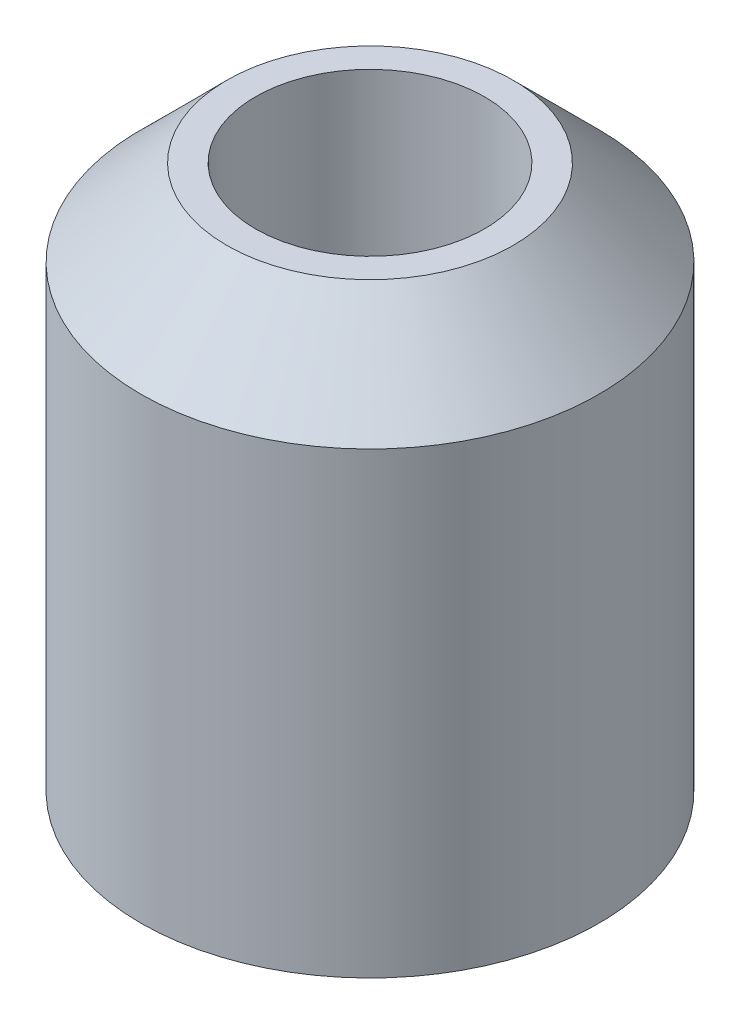
ISO-10303-21;
HEADER;
FILE_DESCRIPTION(('STEP AP214'),'2;1');
FILE_NAME('part.step','',(''),(''),'','','');
FILE_SCHEMA(('AUTOMOTIVE_DESIGN { 1 0 10303 214 1 1 1 1 }'));
ENDSEC;
DATA;
#1=APPLICATION_CONTEXT('core data for automotive mechanical design processes');
#2=APPLICATION_PROTOCOL_DEFINITION('international standard','automotive_design',2000,#1);
#3=PRODUCT_CONTEXT('',#1,'mechanical');
#4=PRODUCT('Part','Part','',(#3));
#5=PRODUCT_RELATED_PRODUCT_CATEGORY('part','',(#4));
#6=PRODUCT_DEFINITION_FORMATION('','',#4);
#7=PRODUCT_DEFINITION_CONTEXT('part definition',#1,'design');
#8=PRODUCT_DEFINITION('design','',#6,#7);
#9=PRODUCT_DEFINITION_SHAPE('','',#8);
#10=(LENGTH_UNIT() NAMED_UNIT(*) SI_UNIT(.MILLI.,.METRE.));
#11=(NAMED_UNIT(*) PLANE_ANGLE_UNIT() SI_UNIT($,.RADIAN.));
#12=(NAMED_UNIT(*) SI_UNIT($,.STERADIAN.) SOLID_ANGLE_UNIT());
#13=UNCERTAINTY_MEASURE_WITH_UNIT(LENGTH_MEASURE(1.E-05),#10,'distance_accuracy_value','');
#14=(GEOMETRIC_REPRESENTATION_CONTEXT(3) GLOBAL_UNCERTAINTY_ASSIGNED_CONTEXT((#13)) GLOBAL_UNIT_ASSIGNED_CONTEXT((#10,
#11,#12)) REPRESENTATION_CONTEXT('',''));
#15=CARTESIAN_POINT('',(0.,0.,0.));
#16=DIRECTION('',(0.,0.,1.));
#17=DIRECTION('',(1.,0.,0.));
#18=AXIS2_PLACEMENT_3D('',#15,#16,#17);
#19=CARTESIAN_POINT('',(0.,27.2130351837984,0.));
#20=DIRECTION('',(0.,1.,0.));
#21=DIRECTION('',(0.,0.,1.));
#22=AXIS2_PLACEMENT_3D('',#19,#20,#21);
#23=CYLINDRICAL_SURFACE('',#22,2.);
#24=CARTESIAN_POINT('',(0.,9.5,0.));
#25=DIRECTION('',(0.,1.,0.));
#26=DIRECTION('',(0.,0.,1.));
#27=AXIS2_PLACEMENT_3D('',#24,#25,#26);
#28=CIRCLE('',#27,2.);
#29=CARTESIAN_POINT('',(0.,9.5,2.));
#30=VERTEX_POINT('',#29);
#31=EDGE_CURVE('E10',#30,#30,#28,.T.);
#32=ORIENTED_EDGE('',*,*,#31,.T.);
#33=EDGE_LOOP('',(#32));
#34=FACE_BOUND('',#33,.T.);
#35=CARTESIAN_POINT('',(0.,0.,0.));
#36=DIRECTION('',(0.,1.,0.));
#37=DIRECTION('',(0.,0.,1.));
#38=AXIS2_PLACEMENT_3D('',#35,#36,#37);
#39=CIRCLE('',#38,2.);
#40=CARTESIAN_POINT('',(0.,0.,2.));
#41=VERTEX_POINT('',#40);
#42=EDGE_CURVE('E50',#41,#41,#39,.T.);
#43=ORIENTED_EDGE('',*,*,#42,.F.);
#44=EDGE_LOOP('',(#43));
#45=FACE_BOUND('',#44,.T.);
#46=ADVANCED_FACE('F31',(#34,#45),#23,.F.);
#47=CARTESIAN_POINT('',(-2.,9.5,0.));
#48=DIRECTION('',(0.,1.,0.));
#49=DIRECTION('',(0.,0.,1.));
#50=AXIS2_PLACEMENT_3D('',#47,#48,#49);
#51=PLANE('',#50);
#52=CARTESIAN_POINT('',(0.,9.5,0.));
#53=DIRECTION('',(0.,1.,0.));
#54=DIRECTION('',(0.,0.,1.));
#55=AXIS2_PLACEMENT_3D('',#52,#53,#54);
#56=CIRCLE('',#55,2.5);
#57=CARTESIAN_POINT('',(0.,9.5,2.5));
#58=VERTEX_POINT('',#57);
#59=EDGE_CURVE('E37',#58,#58,#56,.T.);
#60=ORIENTED_EDGE('',*,*,#59,.T.);
#61=EDGE_LOOP('',(#60));
#62=FACE_BOUND('',#61,.T.);
#63=ORIENTED_EDGE('',*,*,#31,.F.);
#64=EDGE_LOOP('',(#63));
#65=FACE_BOUND('',#64,.T.);
#66=ADVANCED_FACE('F58',(#62,#65),#51,.T.);
#67=CARTESIAN_POINT('',(0.,9.5,0.));
#68=DIRECTION('',(0.,-1.,0.));
#69=DIRECTION('',(0.,0.,-1.));
#70=AXIS2_PLACEMENT_3D('',#67,#68,#69);
#71=CONICAL_SURFACE('',#70,2.5,0.785398163397445);
#72=CARTESIAN_POINT('',(0.,7.99999999999999,0.));
#73=DIRECTION('',(0.,1.,0.));
#74=DIRECTION('',(0.,0.,1.));
#75=AXIS2_PLACEMENT_3D('',#72,#73,#74);
#76=CIRCLE('',#75,4.);
#77=CARTESIAN_POINT('',(0.,7.99999999999999,4.));
#78=VERTEX_POINT('',#77);
#79=EDGE_CURVE('E41',#78,#78,#76,.T.);
#80=ORIENTED_EDGE('',*,*,#79,.T.);
#81=EDGE_LOOP('',(#80));
#82=FACE_BOUND('',#81,.T.);
#83=ORIENTED_EDGE('',*,*,#59,.F.);
#84=EDGE_LOOP('',(#83));
#85=FACE_BOUND('',#84,.T.);
#86=ADVANCED_FACE('F62',(#82,#85),#71,.T.);
#87=CARTESIAN_POINT('',(0.,27.2130351837984,0.));
#88=DIRECTION('',(0.,1.,0.));
#89=DIRECTION('',(0.,0.,1.));
#90=AXIS2_PLACEMENT_3D('',#87,#88,#89);
#91=CYLINDRICAL_SURFACE('',#90,4.);
#92=CARTESIAN_POINT('',(0.,0.,0.));
#93=DIRECTION('',(0.,1.,0.));
#94=DIRECTION('',(0.,0.,1.));
#95=AXIS2_PLACEMENT_3D('',#92,#93,#94);
#96=CIRCLE('',#95,4.);
#97=CARTESIAN_POINT('',(0.,0.,4.));
#98=VERTEX_POINT('',#97);
#99=EDGE_CURVE('E45',#98,#98,#96,.T.);
#100=ORIENTED_EDGE('',*,*,#99,.T.);
#101=EDGE_LOOP('',(#100));
#102=FACE_BOUND('',#101,.T.);
#103=ORIENTED_EDGE('',*,*,#79,.F.);
#104=EDGE_LOOP('',(#103));
#105=FACE_BOUND('',#104,.T.);
#106=ADVANCED_FACE('F66',(#102,#105),#91,.T.);
#107=CARTESIAN_POINT('',(-4.,0.,0.));
#108=DIRECTION('',(0.,-1.,0.));
#109=DIRECTION('',(0.,0.,-1.));
#110=AXIS2_PLACEMENT_3D('',#107,#108,#109);
#111=PLANE('',#110);
#112=ORIENTED_EDGE('',*,*,#42,.T.);
#113=EDGE_LOOP('',(#112));
#114=FACE_BOUND('',#113,.T.);
#115=ORIENTED_EDGE('',*,*,#99,.F.);
#116=EDGE_LOOP('',(#115));
#117=FACE_BOUND('',#116,.T.);
#118=ADVANCED_FACE('F54',(#114,#117),#111,.T.);
#119=CLOSED_SHELL('',(#46,#66,#86,#106,#118));
#120=MANIFOLD_SOLID_BREP('B2',#119);
#121=ADVANCED_BREP_SHAPE_REPRESENTATION('',(#18,#120),#14);
#122=SHAPE_DEFINITION_REPRESENTATION(#9,#121);
ENDSEC;
END-ISO-10303-21;
